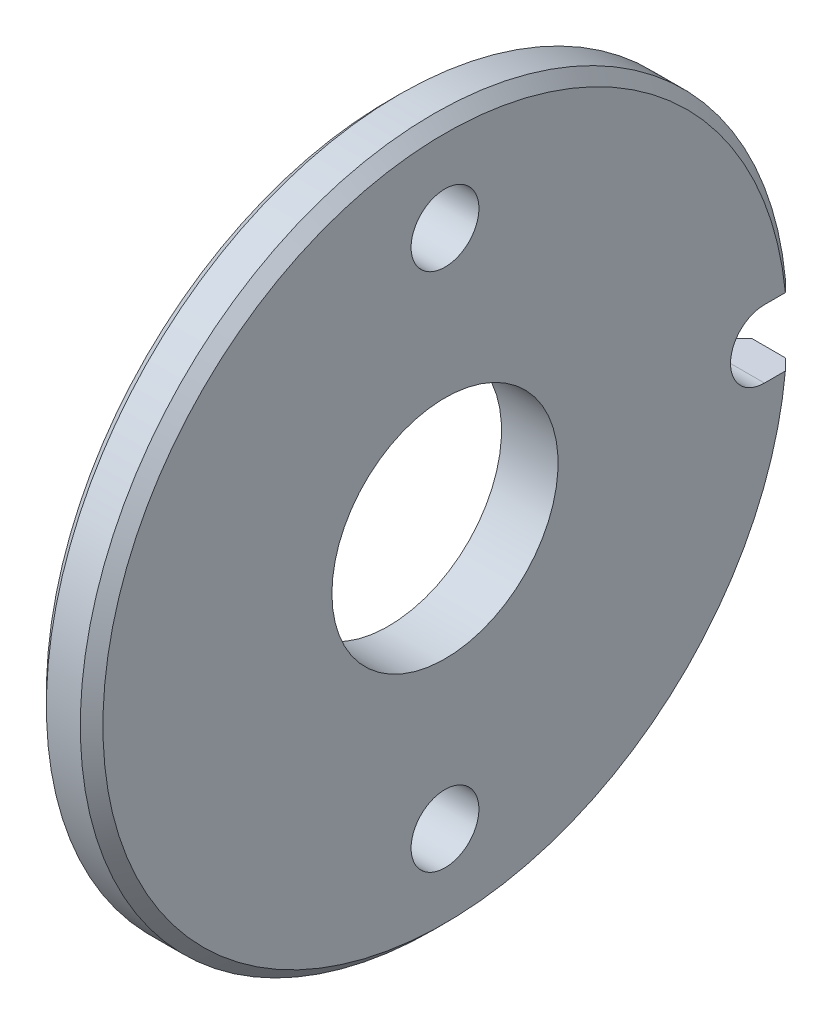
ISO-10303-21;
HEADER;
FILE_DESCRIPTION(('STEP AP214'),'2;1');
FILE_NAME('part.step','',(''),(''),'','','');
FILE_SCHEMA(('AUTOMOTIVE_DESIGN { 1 0 10303 214 1 1 1 1 }'));
ENDSEC;
DATA;
#1=APPLICATION_CONTEXT('core data for automotive mechanical design processes');
#2=APPLICATION_PROTOCOL_DEFINITION('international standard','automotive_design',2000,#1);
#3=PRODUCT_CONTEXT('',#1,'mechanical');
#4=PRODUCT('Part','Part','',(#3));
#5=PRODUCT_RELATED_PRODUCT_CATEGORY('part','',(#4));
#6=PRODUCT_DEFINITION_FORMATION('','',#4);
#7=PRODUCT_DEFINITION_CONTEXT('part definition',#1,'design');
#8=PRODUCT_DEFINITION('design','',#6,#7);
#9=PRODUCT_DEFINITION_SHAPE('','',#8);
#10=(LENGTH_UNIT() NAMED_UNIT(*) SI_UNIT(.MILLI.,.METRE.));
#11=(NAMED_UNIT(*) PLANE_ANGLE_UNIT() SI_UNIT($,.RADIAN.));
#12=(NAMED_UNIT(*) SI_UNIT($,.STERADIAN.) SOLID_ANGLE_UNIT());
#13=UNCERTAINTY_MEASURE_WITH_UNIT(LENGTH_MEASURE(1.E-05),#10,'distance_accuracy_value','');
#14=(GEOMETRIC_REPRESENTATION_CONTEXT(3) GLOBAL_UNCERTAINTY_ASSIGNED_CONTEXT((#13)) GLOBAL_UNIT_ASSIGNED_CONTEXT((#10,
#11,#12)) REPRESENTATION_CONTEXT('',''));
#15=CARTESIAN_POINT('',(0.,0.,0.));
#16=DIRECTION('',(0.,0.,1.));
#17=DIRECTION('',(1.,0.,0.));
#18=AXIS2_PLACEMENT_3D('',#15,#16,#17);
#19=CARTESIAN_POINT('',(1.27,0.,0.));
#20=DIRECTION('',(-1.,0.,0.));
#21=DIRECTION('',(0.,0.,1.));
#22=AXIS2_PLACEMENT_3D('',#19,#20,#21);
#23=CONICAL_SURFACE('',#22,7.68349999977205,0.785398164294891);
#24=CARTESIAN_POINT('',(1.27,0.,0.));
#25=DIRECTION('',(1.,0.,0.));
#26=DIRECTION('',(0.,0.,-1.));
#27=AXIS2_PLACEMENT_3D('',#24,#25,#26);
#28=CIRCLE('',#27,7.68349999977205);
#29=CARTESIAN_POINT('',(1.27,0.762,-7.64562150818998));
#30=VERTEX_POINT('',#29);
#31=CARTESIAN_POINT('',(1.27,-0.762,-7.64562150818998));
#32=VERTEX_POINT('',#31);
#33=EDGE_CURVE('E68',#30,#32,#28,.T.);
#34=ORIENTED_EDGE('',*,*,#33,.F.);
#35=CARTESIAN_POINT('',(1.01600000022795,0.762,-7.90083933832349));
#36=CARTESIAN_POINT('',(1.1006732078725,0.762,-7.81577323862129));
#37=CARTESIAN_POINT('',(1.1853400922736,0.762,-7.73070084431291));
#38=CARTESIAN_POINT('',(1.27,0.762,-7.64562150818998));
#39=B_SPLINE_CURVE_WITH_KNOTS('',3,(#35,#36,#37,#38),.UNSPECIFIED.,.F.,.F.,(4,4),(0.,
0.000360072410359721),.UNSPECIFIED.);
#40=CARTESIAN_POINT('',(1.01600000022795,0.762,-7.90083933832349));
#41=VERTEX_POINT('',#40);
#42=EDGE_CURVE('E93',#41,#30,#39,.T.);
#43=ORIENTED_EDGE('',*,*,#42,.F.);
#44=CARTESIAN_POINT('',(1.01600000022795,0.,0.));
#45=DIRECTION('',(-1.,0.,0.));
#46=DIRECTION('',(0.,0.,-1.));
#47=AXIS2_PLACEMENT_3D('',#44,#45,#46);
#48=CIRCLE('',#47,7.9375);
#49=CARTESIAN_POINT('',(1.01600000022795,-0.762,-7.90083933832349));
#50=VERTEX_POINT('',#49);
#51=EDGE_CURVE('E119',#50,#41,#48,.T.);
#52=ORIENTED_EDGE('',*,*,#51,.F.);
#53=CARTESIAN_POINT('',(1.27,-0.762,-7.64562150818998));
#54=CARTESIAN_POINT('',(1.1853400922736,-0.762,-7.73070084431291));
#55=CARTESIAN_POINT('',(1.1006732078725,-0.762,-7.81577323862129));
#56=CARTESIAN_POINT('',(1.01600000022795,-0.762,-7.90083933832349));
#57=B_SPLINE_CURVE_WITH_KNOTS('',3,(#53,#54,#55,#56),.UNSPECIFIED.,.F.,.F.,(4,4),(0.,
0.000360072410359722),.UNSPECIFIED.);
#58=EDGE_CURVE('E37',#32,#50,#57,.T.);
#59=ORIENTED_EDGE('',*,*,#58,.F.);
#60=EDGE_LOOP('',(#34,#43,#52,#59));
#61=FACE_BOUND('',#60,.T.);
#62=ADVANCED_FACE('F16',(#61),#23,.T.);
#63=CARTESIAN_POINT('',(0.,-5.842,0.));
#64=DIRECTION('',(-1.,0.,0.));
#65=DIRECTION('',(0.,0.,1.));
#66=AXIS2_PLACEMENT_3D('',#63,#64,#65);
#67=CYLINDRICAL_SURFACE('',#66,0.762000000000014);
#68=CARTESIAN_POINT('',(0.,-5.842,0.));
#69=DIRECTION('',(-1.,0.,0.));
#70=DIRECTION('',(0.,0.,1.));
#71=AXIS2_PLACEMENT_3D('',#68,#69,#70);
#72=CIRCLE('',#71,0.762000000000015);
#73=CARTESIAN_POINT('',(0.,-5.842,0.762000000000015));
#74=VERTEX_POINT('',#73);
#75=EDGE_CURVE('E11',#74,#74,#72,.T.);
#76=ORIENTED_EDGE('',*,*,#75,.T.);
#77=EDGE_LOOP('',(#76));
#78=FACE_BOUND('',#77,.T.);
#79=CARTESIAN_POINT('',(1.27000000000001,-5.842,0.));
#80=DIRECTION('',(-1.,0.,0.));
#81=DIRECTION('',(0.,0.,1.));
#82=AXIS2_PLACEMENT_3D('',#79,#80,#81);
#83=CIRCLE('',#82,0.762000000000014);
#84=CARTESIAN_POINT('',(1.27000000000001,-5.842,0.762000000000014));
#85=VERTEX_POINT('',#84);
#86=EDGE_CURVE('E120',#85,#85,#83,.T.);
#87=ORIENTED_EDGE('',*,*,#86,.F.);
#88=EDGE_LOOP('',(#87));
#89=FACE_BOUND('',#88,.T.);
#90=ADVANCED_FACE('F157',(#78,#89),#67,.F.);
#91=CARTESIAN_POINT('',(0.,5.842,0.));
#92=DIRECTION('',(-1.,0.,0.));
#93=DIRECTION('',(0.,0.,1.));
#94=AXIS2_PLACEMENT_3D('',#91,#92,#93);
#95=CYLINDRICAL_SURFACE('',#94,0.762000000000014);
#96=CARTESIAN_POINT('',(0.,5.842,0.));
#97=DIRECTION('',(-1.,0.,0.));
#98=DIRECTION('',(0.,0.,1.));
#99=AXIS2_PLACEMENT_3D('',#96,#97,#98);
#100=CIRCLE('',#99,0.762000000000015);
#101=CARTESIAN_POINT('',(0.,5.842,0.762000000000015));
#102=VERTEX_POINT('',#101);
#103=EDGE_CURVE('E28',#102,#102,#100,.T.);
#104=ORIENTED_EDGE('',*,*,#103,.T.);
#105=EDGE_LOOP('',(#104));
#106=FACE_BOUND('',#105,.T.);
#107=CARTESIAN_POINT('',(1.27000000000001,5.842,0.));
#108=DIRECTION('',(-1.,0.,0.));
#109=DIRECTION('',(0.,0.,1.));
#110=AXIS2_PLACEMENT_3D('',#107,#108,#109);
#111=CIRCLE('',#110,0.762000000000014);
#112=CARTESIAN_POINT('',(1.27000000000001,5.842,0.762000000000014));
#113=VERTEX_POINT('',#112);
#114=EDGE_CURVE('E135',#113,#113,#111,.T.);
#115=ORIENTED_EDGE('',*,*,#114,.F.);
#116=EDGE_LOOP('',(#115));
#117=FACE_BOUND('',#116,.T.);
#118=ADVANCED_FACE('F163',(#106,#117),#95,.F.);
#119=CARTESIAN_POINT('',(0.,0.,0.));
#120=DIRECTION('',(-1.,0.,0.));
#121=DIRECTION('',(0.,0.,1.));
#122=AXIS2_PLACEMENT_3D('',#119,#120,#121);
#123=CYLINDRICAL_SURFACE('',#122,2.54000000000001);
#124=CARTESIAN_POINT('',(0.,0.,0.));
#125=DIRECTION('',(-1.,0.,0.));
#126=DIRECTION('',(0.,0.,1.));
#127=AXIS2_PLACEMENT_3D('',#124,#125,#126);
#128=CIRCLE('',#127,2.54000000000001);
#129=CARTESIAN_POINT('',(0.,0.,2.54000000000001));
#130=VERTEX_POINT('',#129);
#131=EDGE_CURVE('E129',#130,#130,#128,.T.);
#132=ORIENTED_EDGE('',*,*,#131,.T.);
#133=EDGE_LOOP('',(#132));
#134=FACE_BOUND('',#133,.T.);
#135=CARTESIAN_POINT('',(1.27000000000001,0.,0.));
#136=DIRECTION('',(-1.,0.,0.));
#137=DIRECTION('',(0.,0.,1.));
#138=AXIS2_PLACEMENT_3D('',#135,#136,#137);
#139=CIRCLE('',#138,2.54000000000001);
#140=CARTESIAN_POINT('',(1.27000000000001,0.,2.54000000000001));
#141=VERTEX_POINT('',#140);
#142=EDGE_CURVE('E114',#141,#141,#139,.T.);
#143=ORIENTED_EDGE('',*,*,#142,.F.);
#144=EDGE_LOOP('',(#143));
#145=FACE_BOUND('',#144,.T.);
#146=ADVANCED_FACE('F169',(#134,#145),#123,.F.);
#147=CARTESIAN_POINT('',(1.27,0.,-7.1755));
#148=DIRECTION('',(-1.,0.,0.));
#149=DIRECTION('',(0.,0.,1.));
#150=AXIS2_PLACEMENT_3D('',#147,#148,#149);
#151=CYLINDRICAL_SURFACE('',#150,0.762000000000001);
#152=CARTESIAN_POINT('',(1.27,0.,-7.1755));
#153=DIRECTION('',(-1.,0.,0.));
#154=DIRECTION('',(0.,0.,1.));
#155=AXIS2_PLACEMENT_3D('',#152,#153,#154);
#156=CIRCLE('',#155,0.762000000000001);
#157=CARTESIAN_POINT('',(1.27,-0.762,-7.1755));
#158=VERTEX_POINT('',#157);
#159=CARTESIAN_POINT('',(1.27,0.762000000000001,-7.1755));
#160=VERTEX_POINT('',#159);
#161=EDGE_CURVE('E74',#158,#160,#156,.T.);
#162=ORIENTED_EDGE('',*,*,#161,.F.);
#163=DIRECTION('',(-1.,0.,0.));
#164=VECTOR('',#163,1.);
#165=CARTESIAN_POINT('',(1.27,-0.762,-7.1755));
#166=LINE('',#165,#164);
#167=CARTESIAN_POINT('',(0.,-0.762,-7.1755));
#168=VERTEX_POINT('',#167);
#169=EDGE_CURVE('E79',#158,#168,#166,.T.);
#170=ORIENTED_EDGE('',*,*,#169,.T.);
#171=CARTESIAN_POINT('',(0.,0.,-7.1755));
#172=DIRECTION('',(-1.,0.,0.));
#173=DIRECTION('',(0.,0.,1.));
#174=AXIS2_PLACEMENT_3D('',#171,#172,#173);
#175=CIRCLE('',#174,0.762000000000001);
#176=CARTESIAN_POINT('',(0.,0.762000000000001,-7.1755));
#177=VERTEX_POINT('',#176);
#178=EDGE_CURVE('E127',#168,#177,#175,.T.);
#179=ORIENTED_EDGE('',*,*,#178,.T.);
#180=DIRECTION('',(-1.,0.,0.));
#181=VECTOR('',#180,1.);
#182=CARTESIAN_POINT('',(1.27,0.762000000000001,-7.1755));
#183=LINE('',#182,#181);
#184=EDGE_CURVE('E80',#160,#177,#183,.T.);
#185=ORIENTED_EDGE('',*,*,#184,.F.);
#186=EDGE_LOOP('',(#162,#170,#179,#185));
#187=FACE_BOUND('',#186,.T.);
#188=ADVANCED_FACE('F76',(#187),#151,.F.);
#189=CARTESIAN_POINT('',(0.,0.,0.));
#190=DIRECTION('',(1.,0.,0.));
#191=DIRECTION('',(0.,0.,-1.));
#192=AXIS2_PLACEMENT_3D('',#189,#190,#191);
#193=CYLINDRICAL_SURFACE('',#192,7.9375);
#194=DIRECTION('',(-1.,0.,0.));
#195=VECTOR('',#194,1.);
#196=CARTESIAN_POINT('',(1.27,0.762,-7.90083933832349));
#197=LINE('',#196,#195);
#198=CARTESIAN_POINT('',(0.254000000227949,0.762,-7.90083933832349));
#199=VERTEX_POINT('',#198);
#200=EDGE_CURVE('E125',#41,#199,#197,.T.);
#201=ORIENTED_EDGE('',*,*,#200,.T.);
#202=CARTESIAN_POINT('',(0.254000000227949,0.,0.));
#203=DIRECTION('',(1.,0.,0.));
#204=DIRECTION('',(0.,0.,1.));
#205=AXIS2_PLACEMENT_3D('',#202,#203,#204);
#206=CIRCLE('',#205,7.9375);
#207=CARTESIAN_POINT('',(0.254000000227949,-0.762,-7.90083933832349));
#208=VERTEX_POINT('',#207);
#209=EDGE_CURVE('E122',#199,#208,#206,.T.);
#210=ORIENTED_EDGE('',*,*,#209,.T.);
#211=DIRECTION('',(-1.,0.,0.));
#212=VECTOR('',#211,1.);
#213=CARTESIAN_POINT('',(1.27,-0.762,-7.90083933832349));
#214=LINE('',#213,#212);
#215=EDGE_CURVE('E92',#50,#208,#214,.T.);
#216=ORIENTED_EDGE('',*,*,#215,.F.);
#217=ORIENTED_EDGE('',*,*,#51,.T.);
#218=EDGE_LOOP('',(#201,#210,#216,#217));
#219=FACE_BOUND('',#218,.T.);
#220=ADVANCED_FACE('F152',(#219),#193,.T.);
#221=CARTESIAN_POINT('',(0.,7.9375,0.));
#222=DIRECTION('',(-1.,0.,0.));
#223=DIRECTION('',(0.,0.,1.));
#224=AXIS2_PLACEMENT_3D('',#221,#222,#223);
#225=PLANE('',#224);
#226=ORIENTED_EDGE('',*,*,#75,.F.);
#227=EDGE_LOOP('',(#226));
#228=FACE_BOUND('',#227,.T.);
#229=ORIENTED_EDGE('',*,*,#103,.F.);
#230=EDGE_LOOP('',(#229));
#231=FACE_BOUND('',#230,.T.);
#232=ORIENTED_EDGE('',*,*,#131,.F.);
#233=EDGE_LOOP('',(#232));
#234=FACE_BOUND('',#233,.T.);
#235=DIRECTION('',(0.,0.,1.));
#236=VECTOR('',#235,1.);
#237=CARTESIAN_POINT('',(0.,-0.762,-7.90083933832349));
#238=LINE('',#237,#236);
#239=CARTESIAN_POINT('',(0.,-0.762,-7.64562150864814));
#240=VERTEX_POINT('',#239);
#241=EDGE_CURVE('E91',#240,#168,#238,.T.);
#242=ORIENTED_EDGE('',*,*,#241,.F.);
#243=CARTESIAN_POINT('',(0.,0.,0.));
#244=DIRECTION('',(-1.,0.,0.));
#245=DIRECTION('',(0.,0.,1.));
#246=AXIS2_PLACEMENT_3D('',#243,#244,#245);
#247=CIRCLE('',#246,7.68350000022796);
#248=CARTESIAN_POINT('',(0.,0.762,-7.64562150864814));
#249=VERTEX_POINT('',#248);
#250=EDGE_CURVE('E116',#240,#249,#247,.T.);
#251=ORIENTED_EDGE('',*,*,#250,.T.);
#252=DIRECTION('',(0.,0.,-1.));
#253=VECTOR('',#252,1.);
#254=CARTESIAN_POINT('',(0.,0.762000000000001,-7.1755));
#255=LINE('',#254,#253);
#256=EDGE_CURVE('E84',#177,#249,#255,.T.);
#257=ORIENTED_EDGE('',*,*,#256,.F.);
#258=ORIENTED_EDGE('',*,*,#178,.F.);
#259=EDGE_LOOP('',(#242,#251,#257,#258));
#260=FACE_BOUND('',#259,.T.);
#261=ADVANCED_FACE('F178',(#228,#231,#234,#260),#225,.T.);
#262=CARTESIAN_POINT('',(1.27,0.,0.));
#263=DIRECTION('',(1.,0.,0.));
#264=DIRECTION('',(0.,0.,-1.));
#265=AXIS2_PLACEMENT_3D('',#262,#263,#264);
#266=PLANE('',#265);
#267=ORIENTED_EDGE('',*,*,#86,.T.);
#268=EDGE_LOOP('',(#267));
#269=FACE_BOUND('',#268,.T.);
#270=ORIENTED_EDGE('',*,*,#114,.T.);
#271=EDGE_LOOP('',(#270));
#272=FACE_BOUND('',#271,.T.);
#273=ORIENTED_EDGE('',*,*,#142,.T.);
#274=EDGE_LOOP('',(#273));
#275=FACE_BOUND('',#274,.T.);
#276=DIRECTION('',(0.,0.,-1.));
#277=VECTOR('',#276,1.);
#278=CARTESIAN_POINT('',(1.27,0.762000000000001,-7.1755));
#279=LINE('',#278,#277);
#280=EDGE_CURVE('E112',#160,#30,#279,.T.);
#281=ORIENTED_EDGE('',*,*,#280,.T.);
#282=ORIENTED_EDGE('',*,*,#33,.T.);
#283=DIRECTION('',(0.,0.,1.));
#284=VECTOR('',#283,1.);
#285=CARTESIAN_POINT('',(1.27,-0.762,-7.90083933832349));
#286=LINE('',#285,#284);
#287=EDGE_CURVE('E83',#32,#158,#286,.T.);
#288=ORIENTED_EDGE('',*,*,#287,.T.);
#289=ORIENTED_EDGE('',*,*,#161,.T.);
#290=EDGE_LOOP('',(#281,#282,#288,#289));
#291=FACE_BOUND('',#290,.T.);
#292=ADVANCED_FACE('F86',(#269,#272,#275,#291),#266,.T.);
#293=CARTESIAN_POINT('',(1.27,0.762000000000001,-7.1755));
#294=DIRECTION('',(0.,1.,0.));
#295=DIRECTION('',(0.,0.,1.));
#296=AXIS2_PLACEMENT_3D('',#293,#294,#295);
#297=PLANE('',#296);
#298=ORIENTED_EDGE('',*,*,#256,.T.);
#299=CARTESIAN_POINT('',(0.,0.762,-7.64562150864814));
#300=CARTESIAN_POINT('',(0.0846599078783945,0.762,-7.73070084461835));
#301=CARTESIAN_POINT('',(0.169326792431457,0.762,-7.81577323877401));
#302=CARTESIAN_POINT('',(0.254000000227949,0.762,-7.90083933832349));
#303=B_SPLINE_CURVE_WITH_KNOTS('',3,(#299,#300,#301,#302),.UNSPECIFIED.,.F.,.F.,(4,4),(0.,
0.000360072410356576),.UNSPECIFIED.);
#304=EDGE_CURVE('E101',#249,#199,#303,.T.);
#305=ORIENTED_EDGE('',*,*,#304,.T.);
#306=ORIENTED_EDGE('',*,*,#200,.F.);
#307=ORIENTED_EDGE('',*,*,#42,.T.);
#308=ORIENTED_EDGE('',*,*,#280,.F.);
#309=ORIENTED_EDGE('',*,*,#184,.T.);
#310=EDGE_LOOP('',(#298,#305,#306,#307,#308,#309));
#311=FACE_BOUND('',#310,.T.);
#312=ADVANCED_FACE('F154',(#311),#297,.F.);
#313=CARTESIAN_POINT('',(1.27,-0.762,-7.90083933832349));
#314=DIRECTION('',(0.,-1.,0.));
#315=DIRECTION('',(0.,0.,-1.));
#316=AXIS2_PLACEMENT_3D('',#313,#314,#315);
#317=PLANE('',#316);
#318=ORIENTED_EDGE('',*,*,#215,.T.);
#319=CARTESIAN_POINT('',(0.254000000227949,-0.762,-7.90083933832349));
#320=CARTESIAN_POINT('',(0.169326792431458,-0.762,-7.81577323877401));
#321=CARTESIAN_POINT('',(0.0846599078783945,-0.762,-7.73070084461835));
#322=CARTESIAN_POINT('',(0.,-0.762,-7.64562150864814));
#323=B_SPLINE_CURVE_WITH_KNOTS('',3,(#319,#320,#321,#322),.UNSPECIFIED.,.F.,.F.,(4,4),(0.,
0.000360072410356578),.UNSPECIFIED.);
#324=EDGE_CURVE('E20',#208,#240,#323,.T.);
#325=ORIENTED_EDGE('',*,*,#324,.T.);
#326=ORIENTED_EDGE('',*,*,#241,.T.);
#327=ORIENTED_EDGE('',*,*,#169,.F.);
#328=ORIENTED_EDGE('',*,*,#287,.F.);
#329=ORIENTED_EDGE('',*,*,#58,.T.);
#330=EDGE_LOOP('',(#318,#325,#326,#327,#328,#329));
#331=FACE_BOUND('',#330,.T.);
#332=ADVANCED_FACE('F89',(#331),#317,.F.);
#333=CARTESIAN_POINT('',(0.254000000227949,0.,0.));
#334=DIRECTION('',(1.,0.,0.));
#335=DIRECTION('',(0.,0.,-1.));
#336=AXIS2_PLACEMENT_3D('',#333,#334,#335);
#337=CONICAL_SURFACE('',#336,7.9375,0.785398162499995);
#338=ORIENTED_EDGE('',*,*,#304,.F.);
#339=ORIENTED_EDGE('',*,*,#250,.F.);
#340=ORIENTED_EDGE('',*,*,#324,.F.);
#341=ORIENTED_EDGE('',*,*,#209,.F.);
#342=EDGE_LOOP('',(#338,#339,#340,#341));
#343=FACE_BOUND('',#342,.T.);
#344=ADVANCED_FACE('F18',(#343),#337,.T.);
#345=CLOSED_SHELL('',(#62,#90,#118,#146,#188,#220,#261,#292,#312,#332,#344));
#346=MANIFOLD_SOLID_BREP('B1',#345);
#347=ADVANCED_BREP_SHAPE_REPRESENTATION('',(#18,#346),#14);
#348=SHAPE_DEFINITION_REPRESENTATION(#9,#347);
ENDSEC;
END-ISO-10303-21;
